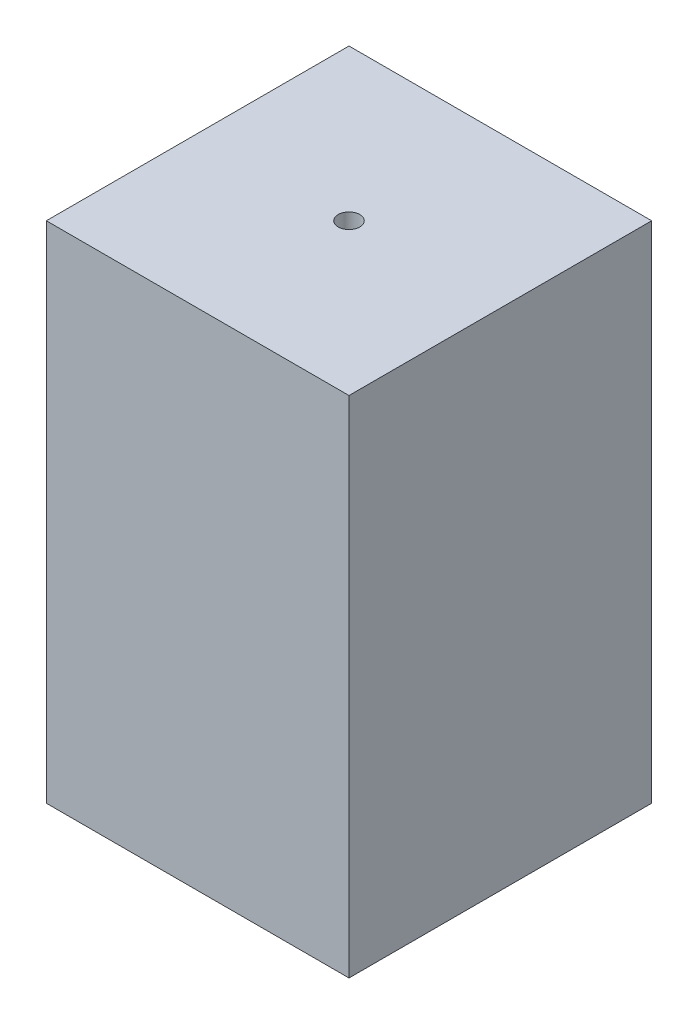
ISO-10303-21;
HEADER;
FILE_DESCRIPTION(('STEP AP214'),'2;1');
FILE_NAME('part.step','',(''),(''),'','','');
FILE_SCHEMA(('AUTOMOTIVE_DESIGN { 1 0 10303 214 1 1 1 1 }'));
ENDSEC;
DATA;
#1=APPLICATION_CONTEXT('core data for automotive mechanical design processes');
#2=APPLICATION_PROTOCOL_DEFINITION('international standard','automotive_design',2000,#1);
#3=PRODUCT_CONTEXT('',#1,'mechanical');
#4=PRODUCT('Part','Part','',(#3));
#5=PRODUCT_RELATED_PRODUCT_CATEGORY('part','',(#4));
#6=PRODUCT_DEFINITION_FORMATION('','',#4);
#7=PRODUCT_DEFINITION_CONTEXT('part definition',#1,'design');
#8=PRODUCT_DEFINITION('design','',#6,#7);
#9=PRODUCT_DEFINITION_SHAPE('','',#8);
#10=(LENGTH_UNIT() NAMED_UNIT(*) SI_UNIT(.MILLI.,.METRE.));
#11=(NAMED_UNIT(*) PLANE_ANGLE_UNIT() SI_UNIT($,.RADIAN.));
#12=(NAMED_UNIT(*) SI_UNIT($,.STERADIAN.) SOLID_ANGLE_UNIT());
#13=UNCERTAINTY_MEASURE_WITH_UNIT(LENGTH_MEASURE(1.E-05),#10,'distance_accuracy_value','');
#14=(GEOMETRIC_REPRESENTATION_CONTEXT(3) GLOBAL_UNCERTAINTY_ASSIGNED_CONTEXT((#13)) GLOBAL_UNIT_ASSIGNED_CONTEXT((#10,
#11,#12)) REPRESENTATION_CONTEXT('',''));
#15=CARTESIAN_POINT('',(0.,0.,0.));
#16=DIRECTION('',(0.,0.,1.));
#17=DIRECTION('',(1.,0.,0.));
#18=AXIS2_PLACEMENT_3D('',#15,#16,#17);
#19=CARTESIAN_POINT('',(0.,10.,0.));
#20=DIRECTION('',(0.,1.,0.));
#21=DIRECTION('',(0.,0.,1.));
#22=AXIS2_PLACEMENT_3D('',#19,#20,#21);
#23=PLANE('',#22);
#24=DIRECTION('',(0.,0.,-1.));
#25=VECTOR('',#24,1.);
#26=CARTESIAN_POINT('',(60.,10.,-60.));
#27=LINE('',#26,#25);
#28=CARTESIAN_POINT('',(60.,10.,60.));
#29=VERTEX_POINT('',#28);
#30=CARTESIAN_POINT('',(60.,10.,-60.));
#31=VERTEX_POINT('',#30);
#32=EDGE_CURVE('E155',#29,#31,#27,.T.);
#33=ORIENTED_EDGE('',*,*,#32,.T.);
#34=DIRECTION('',(-1.,0.,0.));
#35=VECTOR('',#34,1.);
#36=CARTESIAN_POINT('',(-60.,10.,-60.));
#37=LINE('',#36,#35);
#38=CARTESIAN_POINT('',(-60.,10.,-60.));
#39=VERTEX_POINT('',#38);
#40=EDGE_CURVE('E159',#31,#39,#37,.T.);
#41=ORIENTED_EDGE('',*,*,#40,.T.);
#42=DIRECTION('',(0.,0.,1.));
#43=VECTOR('',#42,1.);
#44=CARTESIAN_POINT('',(-60.,10.,-60.));
#45=LINE('',#44,#43);
#46=CARTESIAN_POINT('',(-60.,10.,60.));
#47=VERTEX_POINT('',#46);
#48=EDGE_CURVE('E161',#39,#47,#45,.T.);
#49=ORIENTED_EDGE('',*,*,#48,.T.);
#50=DIRECTION('',(1.,0.,0.));
#51=VECTOR('',#50,1.);
#52=CARTESIAN_POINT('',(-60.,10.,60.));
#53=LINE('',#52,#51);
#54=EDGE_CURVE('E55',#47,#29,#53,.T.);
#55=ORIENTED_EDGE('',*,*,#54,.T.);
#56=EDGE_LOOP('',(#33,#41,#49,#55));
#57=FACE_BOUND('',#56,.T.);
#58=CARTESIAN_POINT('',(0.,10.,0.));
#59=DIRECTION('',(0.,1.,0.));
#60=DIRECTION('',(0.,0.,1.));
#61=AXIS2_PLACEMENT_3D('',#58,#59,#60);
#62=CIRCLE('',#61,4.28571428571428);
#63=CARTESIAN_POINT('',(0.,10.,4.28571428571426));
#64=VERTEX_POINT('',#63);
#65=EDGE_CURVE('E152',#64,#64,#62,.T.);
#66=ORIENTED_EDGE('',*,*,#65,.F.);
#67=EDGE_LOOP('',(#66));
#68=FACE_BOUND('',#67,.T.);
#69=ADVANCED_FACE('F32',(#57,#68),#23,.T.);
#70=CARTESIAN_POINT('',(0.,0.,0.));
#71=DIRECTION('',(0.,1.,0.));
#72=DIRECTION('',(0.,0.,1.));
#73=AXIS2_PLACEMENT_3D('',#70,#71,#72);
#74=PLANE('',#73);
#75=DIRECTION('',(0.,0.,-1.));
#76=VECTOR('',#75,1.);
#77=CARTESIAN_POINT('',(-50.,0.,50.));
#78=LINE('',#77,#76);
#79=CARTESIAN_POINT('',(-50.,0.,50.));
#80=VERTEX_POINT('',#79);
#81=CARTESIAN_POINT('',(-50.,0.,-50.));
#82=VERTEX_POINT('',#81);
#83=EDGE_CURVE('E107',#80,#82,#78,.T.);
#84=ORIENTED_EDGE('',*,*,#83,.T.);
#85=DIRECTION('',(1.,0.,0.));
#86=VECTOR('',#85,1.);
#87=CARTESIAN_POINT('',(-50.,0.,-50.));
#88=LINE('',#87,#86);
#89=CARTESIAN_POINT('',(50.,0.,-50.));
#90=VERTEX_POINT('',#89);
#91=EDGE_CURVE('E127',#82,#90,#88,.T.);
#92=ORIENTED_EDGE('',*,*,#91,.T.);
#93=DIRECTION('',(0.,0.,1.));
#94=VECTOR('',#93,1.);
#95=CARTESIAN_POINT('',(50.,0.,-50.));
#96=LINE('',#95,#94);
#97=CARTESIAN_POINT('',(50.,0.,50.));
#98=VERTEX_POINT('',#97);
#99=EDGE_CURVE('E113',#90,#98,#96,.T.);
#100=ORIENTED_EDGE('',*,*,#99,.T.);
#101=DIRECTION('',(-1.,0.,0.));
#102=VECTOR('',#101,1.);
#103=CARTESIAN_POINT('',(50.,0.,50.));
#104=LINE('',#103,#102);
#105=EDGE_CURVE('E131',#98,#80,#104,.T.);
#106=ORIENTED_EDGE('',*,*,#105,.T.);
#107=EDGE_LOOP('',(#84,#92,#100,#106));
#108=FACE_BOUND('',#107,.T.);
#109=CARTESIAN_POINT('',(0.,0.,0.));
#110=DIRECTION('',(0.,1.,0.));
#111=DIRECTION('',(0.,0.,1.));
#112=AXIS2_PLACEMENT_3D('',#109,#110,#111);
#113=CIRCLE('',#112,4.28571428571428);
#114=CARTESIAN_POINT('',(0.,0.,4.28571428571426));
#115=VERTEX_POINT('',#114);
#116=EDGE_CURVE('E151',#115,#115,#113,.T.);
#117=ORIENTED_EDGE('',*,*,#116,.T.);
#118=EDGE_LOOP('',(#117));
#119=FACE_BOUND('',#118,.T.);
#120=ADVANCED_FACE('F186',(#108,#119),#74,.F.);
#121=CARTESIAN_POINT('',(60.,10.,-60.));
#122=DIRECTION('',(-1.,0.,0.));
#123=DIRECTION('',(0.,0.,1.));
#124=AXIS2_PLACEMENT_3D('',#121,#122,#123);
#125=PLANE('',#124);
#126=DIRECTION('',(0.,-1.,0.));
#127=VECTOR('',#126,1.);
#128=CARTESIAN_POINT('',(60.,10.,60.));
#129=LINE('',#128,#127);
#130=CARTESIAN_POINT('',(60.,-190.,60.));
#131=VERTEX_POINT('',#130);
#132=EDGE_CURVE('E164',#29,#131,#129,.T.);
#133=ORIENTED_EDGE('',*,*,#132,.T.);
#134=DIRECTION('',(0.,0.,1.));
#135=VECTOR('',#134,1.);
#136=CARTESIAN_POINT('',(60.,-190.,-60.));
#137=LINE('',#136,#135);
#138=CARTESIAN_POINT('',(60.,-190.,-60.));
#139=VERTEX_POINT('',#138);
#140=EDGE_CURVE('E142',#139,#131,#137,.T.);
#141=ORIENTED_EDGE('',*,*,#140,.F.);
#142=DIRECTION('',(0.,-1.,0.));
#143=VECTOR('',#142,1.);
#144=CARTESIAN_POINT('',(60.,10.,-60.));
#145=LINE('',#144,#143);
#146=EDGE_CURVE('E11',#31,#139,#145,.T.);
#147=ORIENTED_EDGE('',*,*,#146,.F.);
#148=ORIENTED_EDGE('',*,*,#32,.F.);
#149=EDGE_LOOP('',(#133,#141,#147,#148));
#150=FACE_BOUND('',#149,.T.);
#151=ADVANCED_FACE('F34',(#150),#125,.F.);
#152=CARTESIAN_POINT('',(-60.,10.,-60.));
#153=DIRECTION('',(0.,0.,1.));
#154=DIRECTION('',(1.,0.,0.));
#155=AXIS2_PLACEMENT_3D('',#152,#153,#154);
#156=PLANE('',#155);
#157=CARTESIAN_POINT('',(0.,-174.75,-60.));
#158=DIRECTION('',(0.,0.,-1.));
#159=DIRECTION('',(-1.,0.,0.));
#160=AXIS2_PLACEMENT_3D('',#157,#158,#159);
#161=CIRCLE('',#160,6.5);
#162=CARTESIAN_POINT('',(-6.5,-174.75,-60.));
#163=VERTEX_POINT('',#162);
#164=EDGE_CURVE('E212',#163,#163,#161,.T.);
#165=ORIENTED_EDGE('',*,*,#164,.F.);
#166=EDGE_LOOP('',(#165));
#167=FACE_BOUND('',#166,.T.);
#168=ORIENTED_EDGE('',*,*,#146,.T.);
#169=DIRECTION('',(1.,0.,0.));
#170=VECTOR('',#169,1.);
#171=CARTESIAN_POINT('',(-60.,-190.,-60.));
#172=LINE('',#171,#170);
#173=CARTESIAN_POINT('',(-60.,-190.,-60.));
#174=VERTEX_POINT('',#173);
#175=EDGE_CURVE('E114',#174,#139,#172,.T.);
#176=ORIENTED_EDGE('',*,*,#175,.F.);
#177=DIRECTION('',(0.,-1.,0.));
#178=VECTOR('',#177,1.);
#179=CARTESIAN_POINT('',(-60.,10.,-60.));
#180=LINE('',#179,#178);
#181=EDGE_CURVE('E40',#39,#174,#180,.T.);
#182=ORIENTED_EDGE('',*,*,#181,.F.);
#183=ORIENTED_EDGE('',*,*,#40,.F.);
#184=EDGE_LOOP('',(#168,#176,#182,#183));
#185=FACE_BOUND('',#184,.T.);
#186=ADVANCED_FACE('F177',(#167,#185),#156,.F.);
#187=CARTESIAN_POINT('',(-60.,10.,-60.));
#188=DIRECTION('',(1.,0.,0.));
#189=DIRECTION('',(0.,0.,-1.));
#190=AXIS2_PLACEMENT_3D('',#187,#188,#189);
#191=PLANE('',#190);
#192=ORIENTED_EDGE('',*,*,#181,.T.);
#193=DIRECTION('',(0.,0.,-1.));
#194=VECTOR('',#193,1.);
#195=CARTESIAN_POINT('',(-60.,-190.,60.));
#196=LINE('',#195,#194);
#197=CARTESIAN_POINT('',(-60.,-190.,60.));
#198=VERTEX_POINT('',#197);
#199=EDGE_CURVE('E148',#198,#174,#196,.T.);
#200=ORIENTED_EDGE('',*,*,#199,.F.);
#201=DIRECTION('',(0.,-1.,0.));
#202=VECTOR('',#201,1.);
#203=CARTESIAN_POINT('',(-60.,10.,60.));
#204=LINE('',#203,#202);
#205=EDGE_CURVE('E166',#47,#198,#204,.T.);
#206=ORIENTED_EDGE('',*,*,#205,.F.);
#207=ORIENTED_EDGE('',*,*,#48,.F.);
#208=EDGE_LOOP('',(#192,#200,#206,#207));
#209=FACE_BOUND('',#208,.T.);
#210=ADVANCED_FACE('F171',(#209),#191,.F.);
#211=CARTESIAN_POINT('',(-60.,10.,60.));
#212=DIRECTION('',(0.,0.,-1.));
#213=DIRECTION('',(-1.,0.,0.));
#214=AXIS2_PLACEMENT_3D('',#211,#212,#213);
#215=PLANE('',#214);
#216=ORIENTED_EDGE('',*,*,#205,.T.);
#217=DIRECTION('',(-1.,0.,0.));
#218=VECTOR('',#217,1.);
#219=CARTESIAN_POINT('',(60.,-190.,60.));
#220=LINE('',#219,#218);
#221=EDGE_CURVE('E145',#131,#198,#220,.T.);
#222=ORIENTED_EDGE('',*,*,#221,.F.);
#223=ORIENTED_EDGE('',*,*,#132,.F.);
#224=ORIENTED_EDGE('',*,*,#54,.F.);
#225=EDGE_LOOP('',(#216,#222,#223,#224));
#226=FACE_BOUND('',#225,.T.);
#227=ADVANCED_FACE('F183',(#226),#215,.F.);
#228=CARTESIAN_POINT('',(0.,10.,0.));
#229=DIRECTION('',(0.,-1.,0.));
#230=DIRECTION('',(0.,0.,-1.));
#231=AXIS2_PLACEMENT_3D('',#228,#229,#230);
#232=CYLINDRICAL_SURFACE('',#231,4.28571428571428);
#233=ORIENTED_EDGE('',*,*,#65,.T.);
#234=EDGE_LOOP('',(#233));
#235=FACE_BOUND('',#234,.T.);
#236=ORIENTED_EDGE('',*,*,#116,.F.);
#237=EDGE_LOOP('',(#236));
#238=FACE_BOUND('',#237,.T.);
#239=ADVANCED_FACE('F190',(#235,#238),#232,.F.);
#240=CARTESIAN_POINT('',(0.,-190.,0.));
#241=DIRECTION('',(0.,-1.,0.));
#242=DIRECTION('',(0.,0.,-1.));
#243=AXIS2_PLACEMENT_3D('',#240,#241,#242);
#244=PLANE('',#243);
#245=CARTESIAN_POINT('',(55.,-190.,-55.));
#246=DIRECTION('',(0.,-1.,0.));
#247=DIRECTION('',(0.,0.,-1.));
#248=AXIS2_PLACEMENT_3D('',#245,#246,#247);
#249=CIRCLE('',#248,3.25);
#250=CARTESIAN_POINT('',(55.,-190.,-58.25));
#251=VERTEX_POINT('',#250);
#252=EDGE_CURVE('E214',#251,#251,#249,.T.);
#253=ORIENTED_EDGE('',*,*,#252,.F.);
#254=EDGE_LOOP('',(#253));
#255=FACE_BOUND('',#254,.T.);
#256=CARTESIAN_POINT('',(-55.,-190.,55.));
#257=DIRECTION('',(0.,-1.,0.));
#258=DIRECTION('',(0.,0.,-1.));
#259=AXIS2_PLACEMENT_3D('',#256,#257,#258);
#260=CIRCLE('',#259,3.25);
#261=CARTESIAN_POINT('',(-55.,-190.,51.75));
#262=VERTEX_POINT('',#261);
#263=EDGE_CURVE('E233',#262,#262,#260,.T.);
#264=ORIENTED_EDGE('',*,*,#263,.F.);
#265=EDGE_LOOP('',(#264));
#266=FACE_BOUND('',#265,.T.);
#267=CARTESIAN_POINT('',(55.,-190.,55.));
#268=DIRECTION('',(0.,-1.,0.));
#269=DIRECTION('',(0.,0.,-1.));
#270=AXIS2_PLACEMENT_3D('',#267,#268,#269);
#271=CIRCLE('',#270,3.25);
#272=CARTESIAN_POINT('',(55.,-190.,51.75));
#273=VERTEX_POINT('',#272);
#274=EDGE_CURVE('E227',#273,#273,#271,.T.);
#275=ORIENTED_EDGE('',*,*,#274,.F.);
#276=EDGE_LOOP('',(#275));
#277=FACE_BOUND('',#276,.T.);
#278=CARTESIAN_POINT('',(-55.,-190.,-55.));
#279=DIRECTION('',(0.,-1.,0.));
#280=DIRECTION('',(0.,0.,-1.));
#281=AXIS2_PLACEMENT_3D('',#278,#279,#280);
#282=CIRCLE('',#281,3.25);
#283=CARTESIAN_POINT('',(-55.,-190.,-58.25));
#284=VERTEX_POINT('',#283);
#285=EDGE_CURVE('E226',#284,#284,#282,.T.);
#286=ORIENTED_EDGE('',*,*,#285,.F.);
#287=EDGE_LOOP('',(#286));
#288=FACE_BOUND('',#287,.T.);
#289=ORIENTED_EDGE('',*,*,#175,.T.);
#290=ORIENTED_EDGE('',*,*,#140,.T.);
#291=ORIENTED_EDGE('',*,*,#221,.T.);
#292=ORIENTED_EDGE('',*,*,#199,.T.);
#293=EDGE_LOOP('',(#289,#290,#291,#292));
#294=FACE_BOUND('',#293,.T.);
#295=DIRECTION('',(0.,0.,1.));
#296=VECTOR('',#295,1.);
#297=CARTESIAN_POINT('',(50.,-190.,-50.));
#298=LINE('',#297,#296);
#299=CARTESIAN_POINT('',(50.,-190.,-50.));
#300=VERTEX_POINT('',#299);
#301=CARTESIAN_POINT('',(50.,-190.,50.));
#302=VERTEX_POINT('',#301);
#303=EDGE_CURVE('E106',#300,#302,#298,.T.);
#304=ORIENTED_EDGE('',*,*,#303,.F.);
#305=DIRECTION('',(1.,0.,0.));
#306=VECTOR('',#305,1.);
#307=CARTESIAN_POINT('',(-50.,-190.,-50.));
#308=LINE('',#307,#306);
#309=CARTESIAN_POINT('',(-50.,-190.,-50.));
#310=VERTEX_POINT('',#309);
#311=EDGE_CURVE('E98',#310,#300,#308,.T.);
#312=ORIENTED_EDGE('',*,*,#311,.F.);
#313=DIRECTION('',(0.,0.,-1.));
#314=VECTOR('',#313,1.);
#315=CARTESIAN_POINT('',(-50.,-190.,50.));
#316=LINE('',#315,#314);
#317=CARTESIAN_POINT('',(-50.,-190.,50.));
#318=VERTEX_POINT('',#317);
#319=EDGE_CURVE('E122',#318,#310,#316,.T.);
#320=ORIENTED_EDGE('',*,*,#319,.F.);
#321=DIRECTION('',(-1.,0.,0.));
#322=VECTOR('',#321,1.);
#323=CARTESIAN_POINT('',(50.,-190.,50.));
#324=LINE('',#323,#322);
#325=EDGE_CURVE('E120',#302,#318,#324,.T.);
#326=ORIENTED_EDGE('',*,*,#325,.F.);
#327=EDGE_LOOP('',(#304,#312,#320,#326));
#328=FACE_BOUND('',#327,.T.);
#329=ADVANCED_FACE('F118',(#255,#266,#277,#288,#294,#328),#244,.T.);
#330=CARTESIAN_POINT('',(-50.,-190.,-50.));
#331=DIRECTION('',(0.,0.,1.));
#332=DIRECTION('',(1.,0.,0.));
#333=AXIS2_PLACEMENT_3D('',#330,#331,#332);
#334=PLANE('',#333);
#335=CARTESIAN_POINT('',(0.,-174.75,-50.));
#336=DIRECTION('',(0.,0.,1.));
#337=DIRECTION('',(1.,0.,0.));
#338=AXIS2_PLACEMENT_3D('',#335,#336,#337);
#339=CIRCLE('',#338,6.5);
#340=CARTESIAN_POINT('',(6.5,-174.75,-50.));
#341=VERTEX_POINT('',#340);
#342=EDGE_CURVE('E215',#341,#341,#339,.F.);
#343=ORIENTED_EDGE('',*,*,#342,.T.);
#344=EDGE_LOOP('',(#343));
#345=FACE_BOUND('',#344,.T.);
#346=ORIENTED_EDGE('',*,*,#91,.F.);
#347=DIRECTION('',(0.,1.,0.));
#348=VECTOR('',#347,1.);
#349=CARTESIAN_POINT('',(-50.,-190.,-50.));
#350=LINE('',#349,#348);
#351=EDGE_CURVE('E47',#310,#82,#350,.T.);
#352=ORIENTED_EDGE('',*,*,#351,.F.);
#353=ORIENTED_EDGE('',*,*,#311,.T.);
#354=DIRECTION('',(0.,1.,0.));
#355=VECTOR('',#354,1.);
#356=CARTESIAN_POINT('',(50.,-190.,-50.));
#357=LINE('',#356,#355);
#358=EDGE_CURVE('E101',#300,#90,#357,.T.);
#359=ORIENTED_EDGE('',*,*,#358,.T.);
#360=EDGE_LOOP('',(#346,#352,#353,#359));
#361=FACE_BOUND('',#360,.T.);
#362=ADVANCED_FACE('F100',(#345,#361),#334,.T.);
#363=CARTESIAN_POINT('',(50.,-190.,-50.));
#364=DIRECTION('',(-1.,0.,0.));
#365=DIRECTION('',(0.,0.,1.));
#366=AXIS2_PLACEMENT_3D('',#363,#364,#365);
#367=PLANE('',#366);
#368=ORIENTED_EDGE('',*,*,#99,.F.);
#369=ORIENTED_EDGE('',*,*,#358,.F.);
#370=ORIENTED_EDGE('',*,*,#303,.T.);
#371=DIRECTION('',(0.,1.,0.));
#372=VECTOR('',#371,1.);
#373=CARTESIAN_POINT('',(50.,-190.,50.));
#374=LINE('',#373,#372);
#375=EDGE_CURVE('E115',#302,#98,#374,.T.);
#376=ORIENTED_EDGE('',*,*,#375,.T.);
#377=EDGE_LOOP('',(#368,#369,#370,#376));
#378=FACE_BOUND('',#377,.T.);
#379=ADVANCED_FACE('F110',(#378),#367,.T.);
#380=CARTESIAN_POINT('',(50.,-190.,50.));
#381=DIRECTION('',(0.,0.,-1.));
#382=DIRECTION('',(-1.,0.,0.));
#383=AXIS2_PLACEMENT_3D('',#380,#381,#382);
#384=PLANE('',#383);
#385=ORIENTED_EDGE('',*,*,#105,.F.);
#386=ORIENTED_EDGE('',*,*,#375,.F.);
#387=ORIENTED_EDGE('',*,*,#325,.T.);
#388=DIRECTION('',(0.,1.,0.));
#389=VECTOR('',#388,1.);
#390=CARTESIAN_POINT('',(-50.,-190.,50.));
#391=LINE('',#390,#389);
#392=EDGE_CURVE('E137',#318,#80,#391,.T.);
#393=ORIENTED_EDGE('',*,*,#392,.T.);
#394=EDGE_LOOP('',(#385,#386,#387,#393));
#395=FACE_BOUND('',#394,.T.);
#396=ADVANCED_FACE('F257',(#395),#384,.T.);
#397=CARTESIAN_POINT('',(-50.,-190.,50.));
#398=DIRECTION('',(1.,0.,0.));
#399=DIRECTION('',(0.,0.,-1.));
#400=AXIS2_PLACEMENT_3D('',#397,#398,#399);
#401=PLANE('',#400);
#402=ORIENTED_EDGE('',*,*,#83,.F.);
#403=ORIENTED_EDGE('',*,*,#392,.F.);
#404=ORIENTED_EDGE('',*,*,#319,.T.);
#405=ORIENTED_EDGE('',*,*,#351,.T.);
#406=EDGE_LOOP('',(#402,#403,#404,#405));
#407=FACE_BOUND('',#406,.T.);
#408=ADVANCED_FACE('F260',(#407),#401,.T.);
#409=CARTESIAN_POINT('',(-55.,-175.,-55.));
#410=DIRECTION('',(0.,-1.,0.));
#411=DIRECTION('',(0.,0.,-1.));
#412=AXIS2_PLACEMENT_3D('',#409,#410,#411);
#413=CYLINDRICAL_SURFACE('',#412,3.25);
#414=CARTESIAN_POINT('',(-55.,-175.,-55.));
#415=DIRECTION('',(0.,-1.,0.));
#416=DIRECTION('',(0.,0.,-1.));
#417=AXIS2_PLACEMENT_3D('',#414,#415,#416);
#418=CIRCLE('',#417,3.25);
#419=CARTESIAN_POINT('',(-55.,-175.,-58.25));
#420=VERTEX_POINT('',#419);
#421=EDGE_CURVE('E129',#420,#420,#418,.T.);
#422=ORIENTED_EDGE('',*,*,#421,.F.);
#423=EDGE_LOOP('',(#422));
#424=FACE_BOUND('',#423,.T.);
#425=ORIENTED_EDGE('',*,*,#285,.T.);
#426=EDGE_LOOP('',(#425));
#427=FACE_BOUND('',#426,.T.);
#428=ADVANCED_FACE('F242',(#424,#427),#413,.F.);
#429=CARTESIAN_POINT('',(-55.,-175.,-55.));
#430=DIRECTION('',(0.,-1.,0.));
#431=DIRECTION('',(0.,0.,-1.));
#432=AXIS2_PLACEMENT_3D('',#429,#430,#431);
#433=PLANE('',#432);
#434=ORIENTED_EDGE('',*,*,#421,.T.);
#435=EDGE_LOOP('',(#434));
#436=FACE_BOUND('',#435,.T.);
#437=ADVANCED_FACE('F266',(#436),#433,.T.);
#438=CARTESIAN_POINT('',(55.,-175.,55.));
#439=DIRECTION('',(0.,-1.,0.));
#440=DIRECTION('',(0.,0.,-1.));
#441=AXIS2_PLACEMENT_3D('',#438,#439,#440);
#442=CYLINDRICAL_SURFACE('',#441,3.25);
#443=CARTESIAN_POINT('',(55.,-175.,55.));
#444=DIRECTION('',(0.,-1.,0.));
#445=DIRECTION('',(0.,0.,-1.));
#446=AXIS2_PLACEMENT_3D('',#443,#444,#445);
#447=CIRCLE('',#446,3.25);
#448=CARTESIAN_POINT('',(55.,-175.,51.75));
#449=VERTEX_POINT('',#448);
#450=EDGE_CURVE('E223',#449,#449,#447,.T.);
#451=ORIENTED_EDGE('',*,*,#450,.F.);
#452=EDGE_LOOP('',(#451));
#453=FACE_BOUND('',#452,.T.);
#454=ORIENTED_EDGE('',*,*,#274,.T.);
#455=EDGE_LOOP('',(#454));
#456=FACE_BOUND('',#455,.T.);
#457=ADVANCED_FACE('F270',(#453,#456),#442,.F.);
#458=CARTESIAN_POINT('',(55.,-175.,55.));
#459=DIRECTION('',(0.,-1.,0.));
#460=DIRECTION('',(0.,0.,-1.));
#461=AXIS2_PLACEMENT_3D('',#458,#459,#460);
#462=PLANE('',#461);
#463=ORIENTED_EDGE('',*,*,#450,.T.);
#464=EDGE_LOOP('',(#463));
#465=FACE_BOUND('',#464,.T.);
#466=ADVANCED_FACE('F285',(#465),#462,.T.);
#467=CARTESIAN_POINT('',(-55.,-175.,55.));
#468=DIRECTION('',(0.,-1.,0.));
#469=DIRECTION('',(0.,0.,-1.));
#470=AXIS2_PLACEMENT_3D('',#467,#468,#469);
#471=CYLINDRICAL_SURFACE('',#470,3.25);
#472=CARTESIAN_POINT('',(-55.,-175.,55.));
#473=DIRECTION('',(0.,-1.,0.));
#474=DIRECTION('',(0.,0.,-1.));
#475=AXIS2_PLACEMENT_3D('',#472,#473,#474);
#476=CIRCLE('',#475,3.25);
#477=CARTESIAN_POINT('',(-55.,-175.,51.75));
#478=VERTEX_POINT('',#477);
#479=EDGE_CURVE('E230',#478,#478,#476,.T.);
#480=ORIENTED_EDGE('',*,*,#479,.F.);
#481=EDGE_LOOP('',(#480));
#482=FACE_BOUND('',#481,.T.);
#483=ORIENTED_EDGE('',*,*,#263,.T.);
#484=EDGE_LOOP('',(#483));
#485=FACE_BOUND('',#484,.T.);
#486=ADVANCED_FACE('F282',(#482,#485),#471,.F.);
#487=CARTESIAN_POINT('',(-55.,-175.,55.));
#488=DIRECTION('',(0.,-1.,0.));
#489=DIRECTION('',(0.,0.,-1.));
#490=AXIS2_PLACEMENT_3D('',#487,#488,#489);
#491=PLANE('',#490);
#492=ORIENTED_EDGE('',*,*,#479,.T.);
#493=EDGE_LOOP('',(#492));
#494=FACE_BOUND('',#493,.T.);
#495=ADVANCED_FACE('F276',(#494),#491,.T.);
#496=CARTESIAN_POINT('',(55.,-175.,-55.));
#497=DIRECTION('',(0.,-1.,0.));
#498=DIRECTION('',(0.,0.,-1.));
#499=AXIS2_PLACEMENT_3D('',#496,#497,#498);
#500=CYLINDRICAL_SURFACE('',#499,3.25);
#501=CARTESIAN_POINT('',(55.,-175.,-55.));
#502=DIRECTION('',(0.,-1.,0.));
#503=DIRECTION('',(0.,0.,-1.));
#504=AXIS2_PLACEMENT_3D('',#501,#502,#503);
#505=CIRCLE('',#504,3.25);
#506=CARTESIAN_POINT('',(55.,-175.,-58.25));
#507=VERTEX_POINT('',#506);
#508=EDGE_CURVE('E218',#507,#507,#505,.T.);
#509=ORIENTED_EDGE('',*,*,#508,.F.);
#510=EDGE_LOOP('',(#509));
#511=FACE_BOUND('',#510,.T.);
#512=ORIENTED_EDGE('',*,*,#252,.T.);
#513=EDGE_LOOP('',(#512));
#514=FACE_BOUND('',#513,.T.);
#515=ADVANCED_FACE('F272',(#511,#514),#500,.F.);
#516=CARTESIAN_POINT('',(55.,-175.,-55.));
#517=DIRECTION('',(0.,-1.,0.));
#518=DIRECTION('',(0.,0.,-1.));
#519=AXIS2_PLACEMENT_3D('',#516,#517,#518);
#520=PLANE('',#519);
#521=ORIENTED_EDGE('',*,*,#508,.T.);
#522=EDGE_LOOP('',(#521));
#523=FACE_BOUND('',#522,.T.);
#524=ADVANCED_FACE('F275',(#523),#520,.T.);
#525=CARTESIAN_POINT('',(0.,-174.75,60.001));
#526=DIRECTION('',(0.,0.,-1.));
#527=DIRECTION('',(-1.,0.,0.));
#528=AXIS2_PLACEMENT_3D('',#525,#526,#527);
#529=CYLINDRICAL_SURFACE('',#528,6.5);
#530=ORIENTED_EDGE('',*,*,#342,.F.);
#531=EDGE_LOOP('',(#530));
#532=FACE_BOUND('',#531,.T.);
#533=ORIENTED_EDGE('',*,*,#164,.T.);
#534=EDGE_LOOP('',(#533));
#535=FACE_BOUND('',#534,.T.);
#536=ADVANCED_FACE('F280',(#532,#535),#529,.F.);
#537=CLOSED_SHELL('',(#69,#120,#151,#186,#210,#227,#239,#329,#362,#379,#396,#408,#428,#437,#457,
#466,#486,#495,#515,#524,#536));
#538=MANIFOLD_SOLID_BREP('B2',#537);
#539=ADVANCED_BREP_SHAPE_REPRESENTATION('',(#18,#538),#14);
#540=SHAPE_DEFINITION_REPRESENTATION(#9,#539);
ENDSEC;
END-ISO-10303-21;
